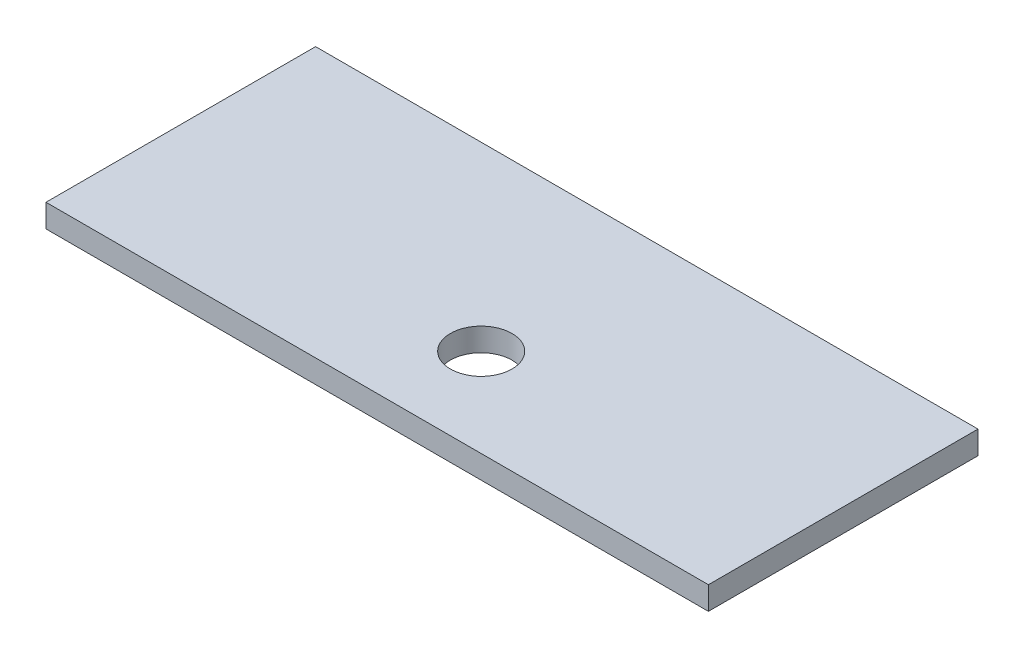
ISO-10303-21;
HEADER;
FILE_DESCRIPTION(('STEP AP214'),'2;1');
FILE_NAME('part.step','',(''),(''),'','','');
FILE_SCHEMA(('AUTOMOTIVE_DESIGN { 1 0 10303 214 1 1 1 1 }'));
ENDSEC;
DATA;
#1=APPLICATION_CONTEXT('core data for automotive mechanical design processes');
#2=APPLICATION_PROTOCOL_DEFINITION('international standard','automotive_design',2000,#1);
#3=PRODUCT_CONTEXT('',#1,'mechanical');
#4=PRODUCT('Part','Part','',(#3));
#5=PRODUCT_RELATED_PRODUCT_CATEGORY('part','',(#4));
#6=PRODUCT_DEFINITION_FORMATION('','',#4);
#7=PRODUCT_DEFINITION_CONTEXT('part definition',#1,'design');
#8=PRODUCT_DEFINITION('design','',#6,#7);
#9=PRODUCT_DEFINITION_SHAPE('','',#8);
#10=(LENGTH_UNIT() NAMED_UNIT(*) SI_UNIT(.MILLI.,.METRE.));
#11=(NAMED_UNIT(*) PLANE_ANGLE_UNIT() SI_UNIT($,.RADIAN.));
#12=(NAMED_UNIT(*) SI_UNIT($,.STERADIAN.) SOLID_ANGLE_UNIT());
#13=UNCERTAINTY_MEASURE_WITH_UNIT(LENGTH_MEASURE(1.E-05),#10,'distance_accuracy_value','');
#14=(GEOMETRIC_REPRESENTATION_CONTEXT(3) GLOBAL_UNCERTAINTY_ASSIGNED_CONTEXT((#13)) GLOBAL_UNIT_ASSIGNED_CONTEXT((#10,
#11,#12)) REPRESENTATION_CONTEXT('',''));
#15=CARTESIAN_POINT('',(0.,0.,0.));
#16=DIRECTION('',(0.,0.,1.));
#17=DIRECTION('',(1.,0.,0.));
#18=AXIS2_PLACEMENT_3D('',#15,#16,#17);
#19=CARTESIAN_POINT('',(0.,1.5,0.));
#20=DIRECTION('',(0.,-1.,0.));
#21=DIRECTION('',(0.,0.,-1.));
#22=AXIS2_PLACEMENT_3D('',#19,#20,#21);
#23=PLANE('',#22);
#24=DIRECTION('',(0.,0.,1.));
#25=VECTOR('',#24,1.);
#26=CARTESIAN_POINT('',(0.,1.5,0.));
#27=LINE('',#26,#25);
#28=CARTESIAN_POINT('',(0.,1.5,-17.5));
#29=VERTEX_POINT('',#28);
#30=CARTESIAN_POINT('',(0.,1.5,0.));
#31=VERTEX_POINT('',#30);
#32=EDGE_CURVE('E85',#29,#31,#27,.T.);
#33=ORIENTED_EDGE('',*,*,#32,.T.);
#34=DIRECTION('',(1.,0.,0.));
#35=VECTOR('',#34,1.);
#36=CARTESIAN_POINT('',(0.,1.5,0.));
#37=LINE('',#36,#35);
#38=CARTESIAN_POINT('',(43.,1.5,0.));
#39=VERTEX_POINT('',#38);
#40=EDGE_CURVE('E80',#31,#39,#37,.T.);
#41=ORIENTED_EDGE('',*,*,#40,.T.);
#42=DIRECTION('',(0.,0.,-1.));
#43=VECTOR('',#42,1.);
#44=CARTESIAN_POINT('',(43.,1.5,0.));
#45=LINE('',#44,#43);
#46=CARTESIAN_POINT('',(43.,1.5,-17.5));
#47=VERTEX_POINT('',#46);
#48=EDGE_CURVE('E83',#39,#47,#45,.T.);
#49=ORIENTED_EDGE('',*,*,#48,.T.);
#50=DIRECTION('',(-1.,0.,0.));
#51=VECTOR('',#50,1.);
#52=CARTESIAN_POINT('',(0.,1.5,-17.5));
#53=LINE('',#52,#51);
#54=EDGE_CURVE('E50',#47,#29,#53,.T.);
#55=ORIENTED_EDGE('',*,*,#54,.T.);
#56=EDGE_LOOP('',(#33,#41,#49,#55));
#57=FACE_BOUND('',#56,.T.);
#58=CARTESIAN_POINT('',(22.5,1.5,-5.75));
#59=DIRECTION('',(0.,1.,0.));
#60=DIRECTION('',(0.,0.,-1.));
#61=AXIS2_PLACEMENT_3D('',#58,#59,#60);
#62=CIRCLE('',#61,2.);
#63=CARTESIAN_POINT('',(22.5,1.5,-7.75));
#64=VERTEX_POINT('',#63);
#65=EDGE_CURVE('E100',#64,#64,#62,.T.);
#66=ORIENTED_EDGE('',*,*,#65,.F.);
#67=EDGE_LOOP('',(#66));
#68=FACE_BOUND('',#67,.T.);
#69=ADVANCED_FACE('F33',(#57,#68),#23,.F.);
#70=CARTESIAN_POINT('',(0.,0.,0.));
#71=DIRECTION('',(0.,-1.,0.));
#72=DIRECTION('',(0.,0.,-1.));
#73=AXIS2_PLACEMENT_3D('',#70,#71,#72);
#74=PLANE('',#73);
#75=DIRECTION('',(0.,0.,1.));
#76=VECTOR('',#75,1.);
#77=CARTESIAN_POINT('',(0.,0.,0.));
#78=LINE('',#77,#76);
#79=CARTESIAN_POINT('',(0.,0.,-17.5));
#80=VERTEX_POINT('',#79);
#81=CARTESIAN_POINT('',(0.,0.,0.));
#82=VERTEX_POINT('',#81);
#83=EDGE_CURVE('E97',#80,#82,#78,.T.);
#84=ORIENTED_EDGE('',*,*,#83,.F.);
#85=DIRECTION('',(-1.,0.,0.));
#86=VECTOR('',#85,1.);
#87=CARTESIAN_POINT('',(0.,0.,-17.5));
#88=LINE('',#87,#86);
#89=CARTESIAN_POINT('',(43.,0.,-17.5));
#90=VERTEX_POINT('',#89);
#91=EDGE_CURVE('E73',#90,#80,#88,.T.);
#92=ORIENTED_EDGE('',*,*,#91,.F.);
#93=DIRECTION('',(0.,0.,-1.));
#94=VECTOR('',#93,1.);
#95=CARTESIAN_POINT('',(43.,0.,0.));
#96=LINE('',#95,#94);
#97=CARTESIAN_POINT('',(43.,0.,0.));
#98=VERTEX_POINT('',#97);
#99=EDGE_CURVE('E67',#98,#90,#96,.T.);
#100=ORIENTED_EDGE('',*,*,#99,.F.);
#101=DIRECTION('',(1.,0.,0.));
#102=VECTOR('',#101,1.);
#103=CARTESIAN_POINT('',(0.,0.,0.));
#104=LINE('',#103,#102);
#105=EDGE_CURVE('E89',#82,#98,#104,.T.);
#106=ORIENTED_EDGE('',*,*,#105,.F.);
#107=EDGE_LOOP('',(#84,#92,#100,#106));
#108=FACE_BOUND('',#107,.T.);
#109=CARTESIAN_POINT('',(22.5,0.,-5.75));
#110=DIRECTION('',(0.,1.,0.));
#111=DIRECTION('',(0.,0.,-1.));
#112=AXIS2_PLACEMENT_3D('',#109,#110,#111);
#113=CIRCLE('',#112,2.);
#114=CARTESIAN_POINT('',(22.5,0.,-7.75));
#115=VERTEX_POINT('',#114);
#116=EDGE_CURVE('E112',#115,#115,#113,.T.);
#117=ORIENTED_EDGE('',*,*,#116,.T.);
#118=EDGE_LOOP('',(#117));
#119=FACE_BOUND('',#118,.T.);
#120=ADVANCED_FACE('F108',(#108,#119),#74,.T.);
#121=CARTESIAN_POINT('',(0.,1.5,0.));
#122=DIRECTION('',(1.,0.,0.));
#123=DIRECTION('',(0.,0.,-1.));
#124=AXIS2_PLACEMENT_3D('',#121,#122,#123);
#125=PLANE('',#124);
#126=ORIENTED_EDGE('',*,*,#83,.T.);
#127=DIRECTION('',(0.,-1.,0.));
#128=VECTOR('',#127,1.);
#129=CARTESIAN_POINT('',(0.,1.5,0.));
#130=LINE('',#129,#128);
#131=EDGE_CURVE('E11',#31,#82,#130,.T.);
#132=ORIENTED_EDGE('',*,*,#131,.F.);
#133=ORIENTED_EDGE('',*,*,#32,.F.);
#134=DIRECTION('',(0.,-1.,0.));
#135=VECTOR('',#134,1.);
#136=CARTESIAN_POINT('',(0.,1.5,-17.5));
#137=LINE('',#136,#135);
#138=EDGE_CURVE('E93',#29,#80,#137,.T.);
#139=ORIENTED_EDGE('',*,*,#138,.T.);
#140=EDGE_LOOP('',(#126,#132,#133,#139));
#141=FACE_BOUND('',#140,.T.);
#142=ADVANCED_FACE('F35',(#141),#125,.F.);
#143=CARTESIAN_POINT('',(0.,1.5,0.));
#144=DIRECTION('',(0.,0.,-1.));
#145=DIRECTION('',(-1.,0.,0.));
#146=AXIS2_PLACEMENT_3D('',#143,#144,#145);
#147=PLANE('',#146);
#148=ORIENTED_EDGE('',*,*,#105,.T.);
#149=DIRECTION('',(0.,-1.,0.));
#150=VECTOR('',#149,1.);
#151=CARTESIAN_POINT('',(43.,1.5,0.));
#152=LINE('',#151,#150);
#153=EDGE_CURVE('E42',#39,#98,#152,.T.);
#154=ORIENTED_EDGE('',*,*,#153,.F.);
#155=ORIENTED_EDGE('',*,*,#40,.F.);
#156=ORIENTED_EDGE('',*,*,#131,.T.);
#157=EDGE_LOOP('',(#148,#154,#155,#156));
#158=FACE_BOUND('',#157,.T.);
#159=ADVANCED_FACE('F88',(#158),#147,.F.);
#160=CARTESIAN_POINT('',(43.,1.5,0.));
#161=DIRECTION('',(-1.,0.,0.));
#162=DIRECTION('',(0.,0.,1.));
#163=AXIS2_PLACEMENT_3D('',#160,#161,#162);
#164=PLANE('',#163);
#165=ORIENTED_EDGE('',*,*,#99,.T.);
#166=DIRECTION('',(0.,-1.,0.));
#167=VECTOR('',#166,1.);
#168=CARTESIAN_POINT('',(43.,1.5,-17.5));
#169=LINE('',#168,#167);
#170=EDGE_CURVE('E90',#47,#90,#169,.T.);
#171=ORIENTED_EDGE('',*,*,#170,.F.);
#172=ORIENTED_EDGE('',*,*,#48,.F.);
#173=ORIENTED_EDGE('',*,*,#153,.T.);
#174=EDGE_LOOP('',(#165,#171,#172,#173));
#175=FACE_BOUND('',#174,.T.);
#176=ADVANCED_FACE('F91',(#175),#164,.F.);
#177=CARTESIAN_POINT('',(0.,1.5,-17.5));
#178=DIRECTION('',(0.,0.,1.));
#179=DIRECTION('',(1.,0.,0.));
#180=AXIS2_PLACEMENT_3D('',#177,#178,#179);
#181=PLANE('',#180);
#182=ORIENTED_EDGE('',*,*,#91,.T.);
#183=ORIENTED_EDGE('',*,*,#138,.F.);
#184=ORIENTED_EDGE('',*,*,#54,.F.);
#185=ORIENTED_EDGE('',*,*,#170,.T.);
#186=EDGE_LOOP('',(#182,#183,#184,#185));
#187=FACE_BOUND('',#186,.T.);
#188=ADVANCED_FACE('F105',(#187),#181,.F.);
#189=CARTESIAN_POINT('',(22.5,1.5,-5.75));
#190=DIRECTION('',(0.,-1.,0.));
#191=DIRECTION('',(0.,0.,-1.));
#192=AXIS2_PLACEMENT_3D('',#189,#190,#191);
#193=CYLINDRICAL_SURFACE('',#192,2.);
#194=ORIENTED_EDGE('',*,*,#65,.T.);
#195=EDGE_LOOP('',(#194));
#196=FACE_BOUND('',#195,.T.);
#197=ORIENTED_EDGE('',*,*,#116,.F.);
#198=EDGE_LOOP('',(#197));
#199=FACE_BOUND('',#198,.T.);
#200=ADVANCED_FACE('F118',(#196,#199),#193,.F.);
#201=CLOSED_SHELL('',(#69,#120,#142,#159,#176,#188,#200));
#202=MANIFOLD_SOLID_BREP('B2',#201);
#203=ADVANCED_BREP_SHAPE_REPRESENTATION('',(#18,#202),#14);
#204=SHAPE_DEFINITION_REPRESENTATION(#9,#203);
ENDSEC;
END-ISO-10303-21;
